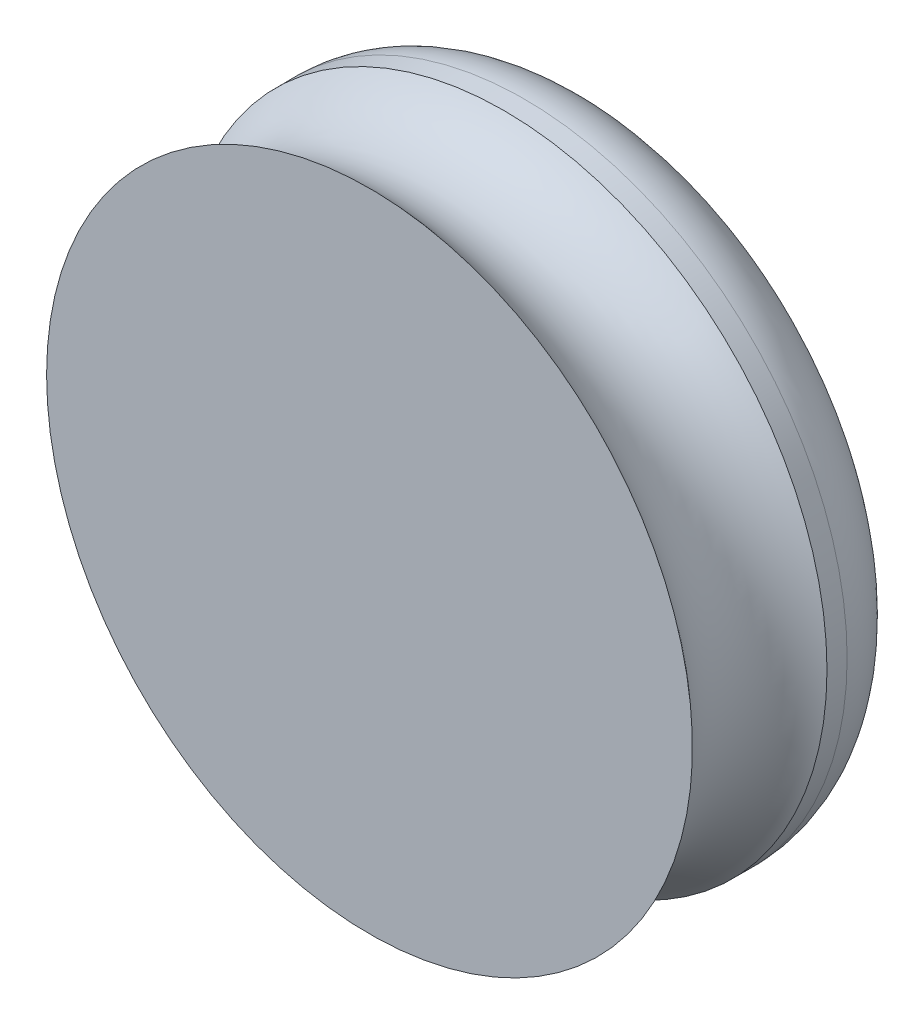
ISO-10303-21;
HEADER;
FILE_DESCRIPTION(('STEP AP214'),'2;1');
FILE_NAME('part.step','',(''),(''),'','','');
FILE_SCHEMA(('AUTOMOTIVE_DESIGN { 1 0 10303 214 1 1 1 1 }'));
ENDSEC;
DATA;
#1=APPLICATION_CONTEXT('core data for automotive mechanical design processes');
#2=APPLICATION_PROTOCOL_DEFINITION('international standard','automotive_design',2000,#1);
#3=PRODUCT_CONTEXT('',#1,'mechanical');
#4=PRODUCT('Part','Part','',(#3));
#5=PRODUCT_RELATED_PRODUCT_CATEGORY('part','',(#4));
#6=PRODUCT_DEFINITION_FORMATION('','',#4);
#7=PRODUCT_DEFINITION_CONTEXT('part definition',#1,'design');
#8=PRODUCT_DEFINITION('design','',#6,#7);
#9=PRODUCT_DEFINITION_SHAPE('','',#8);
#10=(LENGTH_UNIT() NAMED_UNIT(*) SI_UNIT(.MILLI.,.METRE.));
#11=(NAMED_UNIT(*) PLANE_ANGLE_UNIT() SI_UNIT($,.RADIAN.));
#12=(NAMED_UNIT(*) SI_UNIT($,.STERADIAN.) SOLID_ANGLE_UNIT());
#13=UNCERTAINTY_MEASURE_WITH_UNIT(LENGTH_MEASURE(1.E-05),#10,'distance_accuracy_value','');
#14=(GEOMETRIC_REPRESENTATION_CONTEXT(3) GLOBAL_UNCERTAINTY_ASSIGNED_CONTEXT((#13)) GLOBAL_UNIT_ASSIGNED_CONTEXT((#10,
#11,#12)) REPRESENTATION_CONTEXT('',''));
#15=CARTESIAN_POINT('',(0.,0.,0.));
#16=DIRECTION('',(0.,0.,1.));
#17=DIRECTION('',(1.,0.,0.));
#18=AXIS2_PLACEMENT_3D('',#15,#16,#17);
#19=CARTESIAN_POINT('',(-126.423352159799,-34.2539777719791,-5.74999999999909));
#20=DIRECTION('',(0.,0.,-1.));
#21=DIRECTION('',(-1.,0.,0.));
#22=AXIS2_PLACEMENT_3D('',#19,#20,#21);
#23=PLANE('',#22);
#24=CARTESIAN_POINT('',(-127.923352159799,-34.2539777719787,-5.74999999999909));
#25=DIRECTION('',(0.,0.,1.));
#26=DIRECTION('',(1.,0.,0.));
#27=AXIS2_PLACEMENT_3D('',#24,#25,#26);
#28=CIRCLE('',#27,3.);
#29=CARTESIAN_POINT('',(-124.923352159799,-34.2539777719787,-5.74999999999909));
#30=VERTEX_POINT('',#29);
#31=EDGE_CURVE('E23',#30,#30,#28,.T.);
#32=ORIENTED_EDGE('',*,*,#31,.F.);
#33=EDGE_LOOP('',(#32));
#34=FACE_BOUND('',#33,.T.);
#35=ADVANCED_FACE('F19',(#34),#23,.T.);
#36=CARTESIAN_POINT('',(-127.923352159799,-34.2539777719787,-5.74999999999909));
#37=DIRECTION('',(0.,0.,1.));
#38=DIRECTION('',(1.,0.,0.));
#39=AXIS2_PLACEMENT_3D('',#36,#37,#38);
#40=CYLINDRICAL_SURFACE('',#39,3.);
#41=CARTESIAN_POINT('',(-127.923352159799,-34.2539777719787,-5.62999999999909));
#42=DIRECTION('',(0.,0.,1.));
#43=DIRECTION('',(1.,0.,0.));
#44=AXIS2_PLACEMENT_3D('',#41,#42,#43);
#45=CIRCLE('',#44,3.);
#46=CARTESIAN_POINT('',(-124.923352159799,-34.2539777719787,-5.62999999999909));
#47=VERTEX_POINT('',#46);
#48=EDGE_CURVE('E34',#47,#47,#45,.T.);
#49=ORIENTED_EDGE('',*,*,#48,.F.);
#50=EDGE_LOOP('',(#49));
#51=FACE_BOUND('',#50,.T.);
#52=ORIENTED_EDGE('',*,*,#31,.T.);
#53=EDGE_LOOP('',(#52));
#54=FACE_BOUND('',#53,.T.);
#55=ADVANCED_FACE('F45',(#51,#54),#40,.T.);
#56=CARTESIAN_POINT('',(-127.923352159799,-34.2539777719787,-4.7499999999991));
#57=DIRECTION('',(0.,0.,-1.));
#58=DIRECTION('',(-1.,0.,0.));
#59=AXIS2_PLACEMENT_3D('',#56,#57,#58);
#60=TOROIDAL_SURFACE('',#59,3.,0.879999999999994);
#61=ORIENTED_EDGE('',*,*,#48,.T.);
#62=EDGE_LOOP('',(#61));
#63=FACE_BOUND('',#62,.T.);
#64=CARTESIAN_POINT('',(-127.923352159799,-34.2539777719787,-4.74999999999909));
#65=DIRECTION('',(0.,0.,1.));
#66=DIRECTION('',(1.,0.,0.));
#67=AXIS2_PLACEMENT_3D('',#64,#65,#66);
#68=CIRCLE('',#67,3.87999999999999);
#69=CARTESIAN_POINT('',(-124.043352159799,-34.2539777719787,-4.74999999999909));
#70=VERTEX_POINT('',#69);
#71=EDGE_CURVE('E31',#70,#70,#68,.T.);
#72=ORIENTED_EDGE('',*,*,#71,.F.);
#73=EDGE_LOOP('',(#72));
#74=FACE_BOUND('',#73,.T.);
#75=ADVANCED_FACE('F43',(#63,#74),#60,.T.);
#76=CARTESIAN_POINT('',(-127.923352159799,-34.2539777719787,-4.59832371114379));
#77=DIRECTION('',(0.,0.,1.));
#78=DIRECTION('',(1.,0.,0.));
#79=AXIS2_PLACEMENT_3D('',#76,#77,#78);
#80=CYLINDRICAL_SURFACE('',#79,3.87999999999999);
#81=ORIENTED_EDGE('',*,*,#71,.T.);
#82=EDGE_LOOP('',(#81));
#83=FACE_BOUND('',#82,.T.);
#84=CARTESIAN_POINT('',(-127.923352159799,-34.2539777719787,-4.50801829769826));
#85=DIRECTION('',(0.,0.,-1.));
#86=DIRECTION('',(-1.,0.,0.));
#87=AXIS2_PLACEMENT_3D('',#84,#85,#86);
#88=CIRCLE('',#87,3.88);
#89=CARTESIAN_POINT('',(-131.803352159799,-34.2539777719787,-4.50801829769826));
#90=VERTEX_POINT('',#89);
#91=EDGE_CURVE('E27',#90,#90,#88,.T.);
#92=ORIENTED_EDGE('',*,*,#91,.T.);
#93=EDGE_LOOP('',(#92));
#94=FACE_BOUND('',#93,.T.);
#95=ADVANCED_FACE('F40',(#83,#94),#80,.T.);
#96=CARTESIAN_POINT('',(-127.923352159799,-34.2539777719787,-3.69976465134344));
#97=DIRECTION('',(0.,0.,-1.));
#98=DIRECTION('',(-1.,0.,0.));
#99=AXIS2_PLACEMENT_3D('',#96,#97,#98);
#100=TOROIDAL_SURFACE('',#99,4.50254962796091,1.02021664175808);
#101=ORIENTED_EDGE('',*,*,#91,.F.);
#102=EDGE_LOOP('',(#101));
#103=FACE_BOUND('',#102,.T.);
#104=CARTESIAN_POINT('',(-127.923352159799,-34.2539777719787,-2.89151100498954));
#105=DIRECTION('',(0.,0.,-1.));
#106=DIRECTION('',(-1.,0.,0.));
#107=AXIS2_PLACEMENT_3D('',#104,#105,#106);
#108=CIRCLE('',#107,3.8799999999988);
#109=CARTESIAN_POINT('',(-131.803352159798,-34.2539777719787,-2.89151100498954));
#110=VERTEX_POINT('',#109);
#111=EDGE_CURVE('E11',#110,#110,#108,.F.);
#112=ORIENTED_EDGE('',*,*,#111,.F.);
#113=EDGE_LOOP('',(#112));
#114=FACE_BOUND('',#113,.T.);
#115=ADVANCED_FACE('F21',(#103,#114),#100,.F.);
#116=CARTESIAN_POINT('',(-127.923352159799,-34.2539777719787,-2.89151100498954));
#117=DIRECTION('',(0.,0.,1.));
#118=DIRECTION('',(0.,-1.,0.));
#119=AXIS2_PLACEMENT_3D('',#116,#117,#118);
#120=PLANE('',#119);
#121=ORIENTED_EDGE('',*,*,#111,.T.);
#122=EDGE_LOOP('',(#121));
#123=FACE_BOUND('',#122,.T.);
#124=ADVANCED_FACE('F56',(#123),#120,.T.);
#125=CLOSED_SHELL('',(#35,#55,#75,#95,#115,#124));
#126=MANIFOLD_SOLID_BREP('B1',#125);
#127=ADVANCED_BREP_SHAPE_REPRESENTATION('',(#18,#126),#14);
#128=SHAPE_DEFINITION_REPRESENTATION(#9,#127);
ENDSEC;
END-ISO-10303-21;
